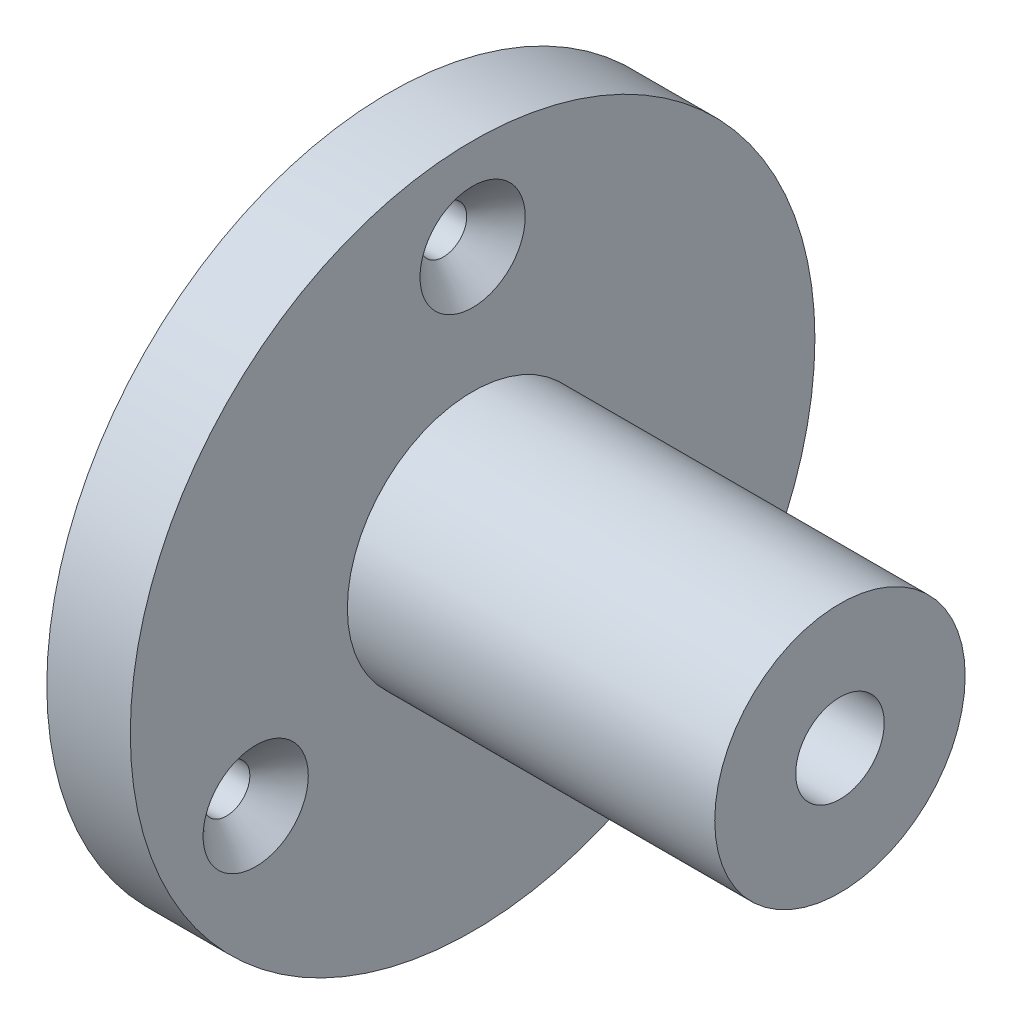
ISO-10303-21;
HEADER;
FILE_DESCRIPTION(('STEP AP214'),'2;1');
FILE_NAME('part.step','',(''),(''),'','','');
FILE_SCHEMA(('AUTOMOTIVE_DESIGN { 1 0 10303 214 1 1 1 1 }'));
ENDSEC;
DATA;
#1=APPLICATION_CONTEXT('core data for automotive mechanical design processes');
#2=APPLICATION_PROTOCOL_DEFINITION('international standard','automotive_design',2000,#1);
#3=PRODUCT_CONTEXT('',#1,'mechanical');
#4=PRODUCT('Part','Part','',(#3));
#5=PRODUCT_RELATED_PRODUCT_CATEGORY('part','',(#4));
#6=PRODUCT_DEFINITION_FORMATION('','',#4);
#7=PRODUCT_DEFINITION_CONTEXT('part definition',#1,'design');
#8=PRODUCT_DEFINITION('design','',#6,#7);
#9=PRODUCT_DEFINITION_SHAPE('','',#8);
#10=(LENGTH_UNIT() NAMED_UNIT(*) SI_UNIT(.MILLI.,.METRE.));
#11=(NAMED_UNIT(*) PLANE_ANGLE_UNIT() SI_UNIT($,.RADIAN.));
#12=(NAMED_UNIT(*) SI_UNIT($,.STERADIAN.) SOLID_ANGLE_UNIT());
#13=UNCERTAINTY_MEASURE_WITH_UNIT(LENGTH_MEASURE(1.E-05),#10,'distance_accuracy_value','');
#14=(GEOMETRIC_REPRESENTATION_CONTEXT(3) GLOBAL_UNCERTAINTY_ASSIGNED_CONTEXT((#13)) GLOBAL_UNIT_ASSIGNED_CONTEXT((#10,
#11,#12)) REPRESENTATION_CONTEXT('',''));
#15=CARTESIAN_POINT('',(0.,0.,0.));
#16=DIRECTION('',(0.,0.,1.));
#17=DIRECTION('',(1.,0.,0.));
#18=AXIS2_PLACEMENT_3D('',#15,#16,#17);
#19=CARTESIAN_POINT('',(-128.207326763593,-109.472547427766,366.77477278685));
#20=DIRECTION('',(-1.,0.,0.));
#21=DIRECTION('',(0.,0.,1.));
#22=AXIS2_PLACEMENT_3D('',#19,#20,#21);
#23=PLANE('',#22);
#24=CARTESIAN_POINT('',(-128.207326763593,-99.1007746482382,319.168616314324));
#25=DIRECTION('',(-1.,0.,0.));
#26=DIRECTION('',(0.,0.,1.));
#27=AXIS2_PLACEMENT_3D('',#24,#25,#26);
#28=CIRCLE('',#27,20.5);
#29=CARTESIAN_POINT('',(-128.207326763593,-99.1007746482382,339.668616314324));
#30=VERTEX_POINT('',#29);
#31=EDGE_CURVE('E47',#30,#30,#28,.T.);
#32=ORIENTED_EDGE('',*,*,#31,.T.);
#33=EDGE_LOOP('',(#32));
#34=FACE_BOUND('',#33,.T.);
#35=CARTESIAN_POINT('',(-128.207326763593,-106.600774648238,306.178235257557));
#36=DIRECTION('',(-1.,0.,0.));
#37=DIRECTION('',(0.,0.,1.));
#38=AXIS2_PLACEMENT_3D('',#35,#36,#37);
#39=CIRCLE('',#38,1.4);
#40=CARTESIAN_POINT('',(-128.207326763593,-106.600774648238,307.578235257557));
#41=VERTEX_POINT('',#40);
#42=EDGE_CURVE('E53',#41,#41,#39,.F.);
#43=ORIENTED_EDGE('',*,*,#42,.T.);
#44=EDGE_LOOP('',(#43));
#45=FACE_BOUND('',#44,.T.);
#46=CARTESIAN_POINT('',(-128.207326763593,-84.1007746482382,319.168616314324));
#47=DIRECTION('',(-1.,0.,0.));
#48=DIRECTION('',(0.,0.,1.));
#49=AXIS2_PLACEMENT_3D('',#46,#47,#48);
#50=CIRCLE('',#49,1.4);
#51=CARTESIAN_POINT('',(-128.207326763593,-84.1007746482382,320.568616314324));
#52=VERTEX_POINT('',#51);
#53=EDGE_CURVE('E34',#52,#52,#50,.F.);
#54=ORIENTED_EDGE('',*,*,#53,.T.);
#55=EDGE_LOOP('',(#54));
#56=FACE_BOUND('',#55,.T.);
#57=CARTESIAN_POINT('',(-128.207326763593,-106.600774648238,332.15899737109));
#58=DIRECTION('',(-1.,0.,0.));
#59=DIRECTION('',(0.,0.,1.));
#60=AXIS2_PLACEMENT_3D('',#57,#58,#59);
#61=CIRCLE('',#60,1.4);
#62=CARTESIAN_POINT('',(-128.207326763593,-106.600774648238,333.55899737109));
#63=VERTEX_POINT('',#62);
#64=EDGE_CURVE('E51',#63,#63,#61,.F.);
#65=ORIENTED_EDGE('',*,*,#64,.T.);
#66=EDGE_LOOP('',(#65));
#67=FACE_BOUND('',#66,.T.);
#68=ADVANCED_FACE('F30',(#34,#45,#56,#67),#23,.T.);
#69=CARTESIAN_POINT('',(-106.207326763593,-99.1007746482382,319.168616314324));
#70=DIRECTION('',(1.,0.,0.));
#71=DIRECTION('',(0.,0.,-1.));
#72=AXIS2_PLACEMENT_3D('',#69,#70,#71);
#73=PLANE('',#72);
#74=CARTESIAN_POINT('',(-106.207326763593,-99.1007746482382,319.168616314324));
#75=DIRECTION('',(1.,0.,0.));
#76=DIRECTION('',(0.,0.,-1.));
#77=AXIS2_PLACEMENT_3D('',#74,#75,#76);
#78=CIRCLE('',#77,2.64999999999999);
#79=CARTESIAN_POINT('',(-106.207326763593,-99.1007746482382,316.518616314324));
#80=VERTEX_POINT('',#79);
#81=EDGE_CURVE('E146',#80,#80,#78,.T.);
#82=ORIENTED_EDGE('',*,*,#81,.T.);
#83=EDGE_LOOP('',(#82));
#84=FACE_BOUND('',#83,.T.);
#85=ADVANCED_FACE('F79',(#84),#73,.T.);
#86=CARTESIAN_POINT('',(-106.207326763593,-99.1007746482382,319.168616314324));
#87=DIRECTION('',(1.,0.,0.));
#88=DIRECTION('',(0.,0.,-1.));
#89=AXIS2_PLACEMENT_3D('',#86,#87,#88);
#90=CYLINDRICAL_SURFACE('',#89,2.64999999999999);
#91=ORIENTED_EDGE('',*,*,#81,.F.);
#92=EDGE_LOOP('',(#91));
#93=FACE_BOUND('',#92,.T.);
#94=CARTESIAN_POINT('',(-101.207326763593,-99.1007746482382,319.168616314324));
#95=DIRECTION('',(1.,0.,0.));
#96=DIRECTION('',(0.,0.,-1.));
#97=AXIS2_PLACEMENT_3D('',#94,#95,#96);
#98=CIRCLE('',#97,2.64999999999999);
#99=CARTESIAN_POINT('',(-101.207326763593,-99.1007746482382,316.518616314324));
#100=VERTEX_POINT('',#99);
#101=EDGE_CURVE('E50',#100,#100,#98,.T.);
#102=ORIENTED_EDGE('',*,*,#101,.T.);
#103=EDGE_LOOP('',(#102));
#104=FACE_BOUND('',#103,.T.);
#105=ADVANCED_FACE('F81',(#93,#104),#90,.F.);
#106=CARTESIAN_POINT('',(-101.207326763593,-99.1007746482382,319.168616314324));
#107=DIRECTION('',(1.,0.,0.));
#108=DIRECTION('',(0.,0.,-1.));
#109=AXIS2_PLACEMENT_3D('',#106,#107,#108);
#110=PLANE('',#109);
#111=ORIENTED_EDGE('',*,*,#101,.F.);
#112=EDGE_LOOP('',(#111));
#113=FACE_BOUND('',#112,.T.);
#114=CARTESIAN_POINT('',(-101.207326763593,-99.1007746482382,319.168616314324));
#115=DIRECTION('',(1.,0.,0.));
#116=DIRECTION('',(0.,0.,-1.));
#117=AXIS2_PLACEMENT_3D('',#114,#115,#116);
#118=CIRCLE('',#117,7.50000000000001);
#119=CARTESIAN_POINT('',(-101.207326763593,-99.1007746482382,311.668616314324));
#120=VERTEX_POINT('',#119);
#121=EDGE_CURVE('E143',#120,#120,#118,.T.);
#122=ORIENTED_EDGE('',*,*,#121,.T.);
#123=EDGE_LOOP('',(#122));
#124=FACE_BOUND('',#123,.T.);
#125=ADVANCED_FACE('F88',(#113,#124),#110,.T.);
#126=CARTESIAN_POINT('',(-101.207326763593,-99.1007746482382,319.168616314324));
#127=DIRECTION('',(-1.,0.,0.));
#128=DIRECTION('',(0.,0.,1.));
#129=AXIS2_PLACEMENT_3D('',#126,#127,#128);
#130=CYLINDRICAL_SURFACE('',#129,7.50000000000001);
#131=ORIENTED_EDGE('',*,*,#121,.F.);
#132=EDGE_LOOP('',(#131));
#133=FACE_BOUND('',#132,.T.);
#134=CARTESIAN_POINT('',(-123.207326763593,-99.1007746482382,319.168616314324));
#135=DIRECTION('',(1.,0.,0.));
#136=DIRECTION('',(0.,0.,-1.));
#137=AXIS2_PLACEMENT_3D('',#134,#135,#136);
#138=CIRCLE('',#137,7.50000000000001);
#139=CARTESIAN_POINT('',(-123.207326763593,-99.1007746482382,311.668616314324));
#140=VERTEX_POINT('',#139);
#141=EDGE_CURVE('E128',#140,#140,#138,.T.);
#142=ORIENTED_EDGE('',*,*,#141,.T.);
#143=EDGE_LOOP('',(#142));
#144=FACE_BOUND('',#143,.T.);
#145=ADVANCED_FACE('F98',(#133,#144),#130,.T.);
#146=CARTESIAN_POINT('',(-123.207326763593,-99.1007746482382,319.168616314324));
#147=DIRECTION('',(1.,0.,0.));
#148=DIRECTION('',(0.,0.,-1.));
#149=AXIS2_PLACEMENT_3D('',#146,#147,#148);
#150=PLANE('',#149);
#151=CARTESIAN_POINT('',(-123.207326763593,-84.1007746482382,319.168616314324));
#152=DIRECTION('',(1.,0.,0.));
#153=DIRECTION('',(0.,0.,-1.));
#154=AXIS2_PLACEMENT_3D('',#151,#152,#153);
#155=CIRCLE('',#154,3.15);
#156=CARTESIAN_POINT('',(-123.207326763593,-84.1007746482382,316.018616314324));
#157=VERTEX_POINT('',#156);
#158=EDGE_CURVE('E10',#157,#157,#155,.T.);
#159=ORIENTED_EDGE('',*,*,#158,.F.);
#160=EDGE_LOOP('',(#159));
#161=FACE_BOUND('',#160,.T.);
#162=CARTESIAN_POINT('',(-123.207326763593,-106.600774648238,306.178235257557));
#163=DIRECTION('',(1.,0.,0.));
#164=DIRECTION('',(0.,0.,-1.));
#165=AXIS2_PLACEMENT_3D('',#162,#163,#164);
#166=CIRCLE('',#165,3.15);
#167=CARTESIAN_POINT('',(-123.207326763593,-106.600774648238,303.028235257557));
#168=VERTEX_POINT('',#167);
#169=EDGE_CURVE('E43',#168,#168,#166,.T.);
#170=ORIENTED_EDGE('',*,*,#169,.F.);
#171=EDGE_LOOP('',(#170));
#172=FACE_BOUND('',#171,.T.);
#173=CARTESIAN_POINT('',(-123.207326763593,-106.600774648238,332.15899737109));
#174=DIRECTION('',(1.,0.,0.));
#175=DIRECTION('',(0.,0.,-1.));
#176=AXIS2_PLACEMENT_3D('',#173,#174,#175);
#177=CIRCLE('',#176,3.15);
#178=CARTESIAN_POINT('',(-123.207326763593,-106.600774648238,329.00899737109));
#179=VERTEX_POINT('',#178);
#180=EDGE_CURVE('E122',#179,#179,#177,.T.);
#181=ORIENTED_EDGE('',*,*,#180,.F.);
#182=EDGE_LOOP('',(#181));
#183=FACE_BOUND('',#182,.T.);
#184=ORIENTED_EDGE('',*,*,#141,.F.);
#185=EDGE_LOOP('',(#184));
#186=FACE_BOUND('',#185,.T.);
#187=CARTESIAN_POINT('',(-123.207326763593,-99.1007746482382,319.168616314324));
#188=DIRECTION('',(1.,0.,0.));
#189=DIRECTION('',(0.,0.,-1.));
#190=AXIS2_PLACEMENT_3D('',#187,#188,#189);
#191=CIRCLE('',#190,20.5);
#192=CARTESIAN_POINT('',(-123.207326763593,-99.1007746482382,298.668616314324));
#193=VERTEX_POINT('',#192);
#194=EDGE_CURVE('E141',#193,#193,#191,.T.);
#195=ORIENTED_EDGE('',*,*,#194,.T.);
#196=EDGE_LOOP('',(#195));
#197=FACE_BOUND('',#196,.T.);
#198=ADVANCED_FACE('F102',(#161,#172,#183,#186,#197),#150,.T.);
#199=CARTESIAN_POINT('',(259.738182534977,-99.1007746482382,319.168616314324));
#200=DIRECTION('',(-1.,0.,0.));
#201=DIRECTION('',(0.,0.,1.));
#202=AXIS2_PLACEMENT_3D('',#199,#200,#201);
#203=CYLINDRICAL_SURFACE('',#202,20.5);
#204=ORIENTED_EDGE('',*,*,#194,.F.);
#205=EDGE_LOOP('',(#204));
#206=FACE_BOUND('',#205,.T.);
#207=ORIENTED_EDGE('',*,*,#31,.F.);
#208=EDGE_LOOP('',(#207));
#209=FACE_BOUND('',#208,.T.);
#210=ADVANCED_FACE('F32',(#206,#209),#203,.T.);
#211=CARTESIAN_POINT('',(-123.207326763593,-84.1007746482382,319.168616314324));
#212=DIRECTION('',(1.,0.,0.));
#213=DIRECTION('',(0.,0.,-1.));
#214=AXIS2_PLACEMENT_3D('',#211,#212,#213);
#215=CONICAL_SURFACE('',#214,3.15,0.785398163397448);
#216=CARTESIAN_POINT('',(-124.957326763593,-84.1007746482382,319.168616314324));
#217=DIRECTION('',(1.,0.,0.));
#218=DIRECTION('',(0.,0.,-1.));
#219=AXIS2_PLACEMENT_3D('',#216,#217,#218);
#220=CIRCLE('',#219,1.4);
#221=CARTESIAN_POINT('',(-124.957326763593,-84.1007746482382,317.768616314324));
#222=VERTEX_POINT('',#221);
#223=EDGE_CURVE('E38',#222,#222,#220,.T.);
#224=ORIENTED_EDGE('',*,*,#223,.F.);
#225=EDGE_LOOP('',(#224));
#226=FACE_BOUND('',#225,.T.);
#227=ORIENTED_EDGE('',*,*,#158,.T.);
#228=EDGE_LOOP('',(#227));
#229=FACE_BOUND('',#228,.T.);
#230=ADVANCED_FACE('F65',(#226,#229),#215,.F.);
#231=CARTESIAN_POINT('',(-123.207326763593,-84.1007746482382,319.168616314324));
#232=DIRECTION('',(1.,0.,0.));
#233=DIRECTION('',(0.,0.,-1.));
#234=AXIS2_PLACEMENT_3D('',#231,#232,#233);
#235=CYLINDRICAL_SURFACE('',#234,1.4);
#236=ORIENTED_EDGE('',*,*,#223,.T.);
#237=EDGE_LOOP('',(#236));
#238=FACE_BOUND('',#237,.T.);
#239=ORIENTED_EDGE('',*,*,#53,.F.);
#240=EDGE_LOOP('',(#239));
#241=FACE_BOUND('',#240,.T.);
#242=ADVANCED_FACE('F62',(#238,#241),#235,.F.);
#243=CARTESIAN_POINT('',(-123.207326763593,-106.600774648238,306.178235257557));
#244=DIRECTION('',(1.,0.,0.));
#245=DIRECTION('',(0.,0.,-1.));
#246=AXIS2_PLACEMENT_3D('',#243,#244,#245);
#247=CONICAL_SURFACE('',#246,3.15,0.785398163397448);
#248=CARTESIAN_POINT('',(-124.957326763593,-106.600774648238,306.178235257557));
#249=DIRECTION('',(1.,0.,0.));
#250=DIRECTION('',(0.,0.,-1.));
#251=AXIS2_PLACEMENT_3D('',#248,#249,#250);
#252=CIRCLE('',#251,1.4);
#253=CARTESIAN_POINT('',(-124.957326763593,-106.600774648238,304.778235257557));
#254=VERTEX_POINT('',#253);
#255=EDGE_CURVE('E124',#254,#254,#252,.T.);
#256=ORIENTED_EDGE('',*,*,#255,.F.);
#257=EDGE_LOOP('',(#256));
#258=FACE_BOUND('',#257,.T.);
#259=ORIENTED_EDGE('',*,*,#169,.T.);
#260=EDGE_LOOP('',(#259));
#261=FACE_BOUND('',#260,.T.);
#262=ADVANCED_FACE('F64',(#258,#261),#247,.F.);
#263=CARTESIAN_POINT('',(-123.207326763593,-106.600774648238,306.178235257557));
#264=DIRECTION('',(1.,0.,0.));
#265=DIRECTION('',(0.,0.,-1.));
#266=AXIS2_PLACEMENT_3D('',#263,#264,#265);
#267=CYLINDRICAL_SURFACE('',#266,1.4);
#268=ORIENTED_EDGE('',*,*,#255,.T.);
#269=EDGE_LOOP('',(#268));
#270=FACE_BOUND('',#269,.T.);
#271=ORIENTED_EDGE('',*,*,#42,.F.);
#272=EDGE_LOOP('',(#271));
#273=FACE_BOUND('',#272,.T.);
#274=ADVANCED_FACE('F72',(#270,#273),#267,.F.);
#275=CARTESIAN_POINT('',(-123.207326763593,-106.600774648238,332.15899737109));
#276=DIRECTION('',(1.,0.,0.));
#277=DIRECTION('',(0.,0.,-1.));
#278=AXIS2_PLACEMENT_3D('',#275,#276,#277);
#279=CONICAL_SURFACE('',#278,3.15,0.785398163397448);
#280=CARTESIAN_POINT('',(-124.957326763593,-106.600774648238,332.15899737109));
#281=DIRECTION('',(1.,0.,0.));
#282=DIRECTION('',(0.,0.,-1.));
#283=AXIS2_PLACEMENT_3D('',#280,#281,#282);
#284=CIRCLE('',#283,1.4);
#285=CARTESIAN_POINT('',(-124.957326763593,-106.600774648238,330.75899737109));
#286=VERTEX_POINT('',#285);
#287=EDGE_CURVE('E119',#286,#286,#284,.T.);
#288=ORIENTED_EDGE('',*,*,#287,.F.);
#289=EDGE_LOOP('',(#288));
#290=FACE_BOUND('',#289,.T.);
#291=ORIENTED_EDGE('',*,*,#180,.T.);
#292=EDGE_LOOP('',(#291));
#293=FACE_BOUND('',#292,.T.);
#294=ADVANCED_FACE('F107',(#290,#293),#279,.F.);
#295=CARTESIAN_POINT('',(-123.207326763593,-106.600774648238,332.15899737109));
#296=DIRECTION('',(1.,0.,0.));
#297=DIRECTION('',(0.,0.,-1.));
#298=AXIS2_PLACEMENT_3D('',#295,#296,#297);
#299=CYLINDRICAL_SURFACE('',#298,1.4);
#300=ORIENTED_EDGE('',*,*,#287,.T.);
#301=EDGE_LOOP('',(#300));
#302=FACE_BOUND('',#301,.T.);
#303=ORIENTED_EDGE('',*,*,#64,.F.);
#304=EDGE_LOOP('',(#303));
#305=FACE_BOUND('',#304,.T.);
#306=ADVANCED_FACE('F93',(#302,#305),#299,.F.);
#307=CLOSED_SHELL('',(#68,#85,#105,#125,#145,#198,#210,#230,#242,#262,#274,#294,#306));
#308=MANIFOLD_SOLID_BREP('B2',#307);
#309=ADVANCED_BREP_SHAPE_REPRESENTATION('',(#18,#308),#14);
#310=SHAPE_DEFINITION_REPRESENTATION(#9,#309);
ENDSEC;
END-ISO-10303-21;
